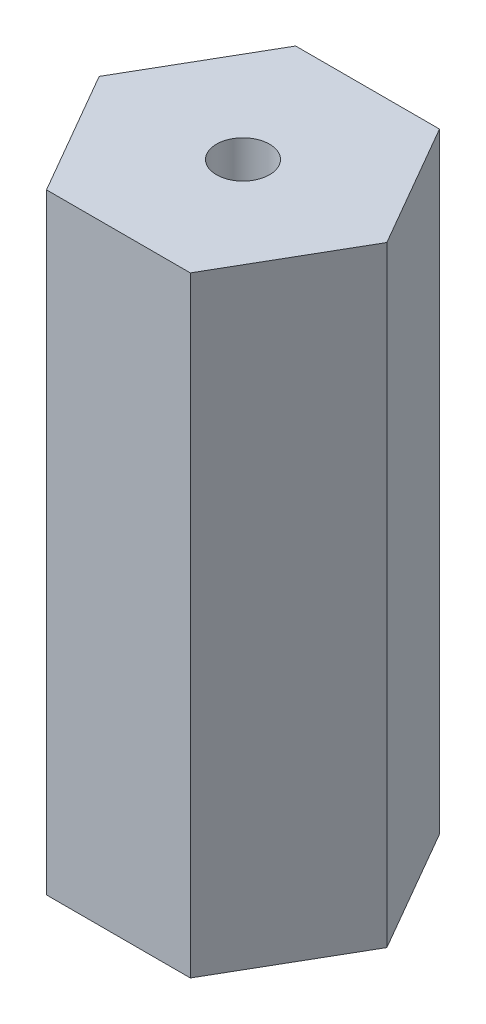
ISO-10303-21;
HEADER;
FILE_DESCRIPTION(('STEP AP214'),'2;1');
FILE_NAME('part.step','',(''),(''),'','','');
FILE_SCHEMA(('AUTOMOTIVE_DESIGN { 1 0 10303 214 1 1 1 1 }'));
ENDSEC;
DATA;
#1=APPLICATION_CONTEXT('core data for automotive mechanical design processes');
#2=APPLICATION_PROTOCOL_DEFINITION('international standard','automotive_design',2000,#1);
#3=PRODUCT_CONTEXT('',#1,'mechanical');
#4=PRODUCT('Part','Part','',(#3));
#5=PRODUCT_RELATED_PRODUCT_CATEGORY('part','',(#4));
#6=PRODUCT_DEFINITION_FORMATION('','',#4);
#7=PRODUCT_DEFINITION_CONTEXT('part definition',#1,'design');
#8=PRODUCT_DEFINITION('design','',#6,#7);
#9=PRODUCT_DEFINITION_SHAPE('','',#8);
#10=(LENGTH_UNIT() NAMED_UNIT(*) SI_UNIT(.MILLI.,.METRE.));
#11=(NAMED_UNIT(*) PLANE_ANGLE_UNIT() SI_UNIT($,.RADIAN.));
#12=(NAMED_UNIT(*) SI_UNIT($,.STERADIAN.) SOLID_ANGLE_UNIT());
#13=UNCERTAINTY_MEASURE_WITH_UNIT(LENGTH_MEASURE(1.E-05),#10,'distance_accuracy_value','');
#14=(GEOMETRIC_REPRESENTATION_CONTEXT(3) GLOBAL_UNCERTAINTY_ASSIGNED_CONTEXT((#13)) GLOBAL_UNIT_ASSIGNED_CONTEXT((#10,
#11,#12)) REPRESENTATION_CONTEXT('',''));
#15=CARTESIAN_POINT('',(0.,0.,0.));
#16=DIRECTION('',(0.,0.,1.));
#17=DIRECTION('',(1.,0.,0.));
#18=AXIS2_PLACEMENT_3D('',#15,#16,#17);
#19=CARTESIAN_POINT('',(7.04367328411343,29.90078,0.));
#20=DIRECTION('',(-0.866025403784439,0.,0.5));
#21=DIRECTION('',(0.5,0.,0.866025403784439));
#22=AXIS2_PLACEMENT_3D('',#19,#20,#21);
#23=PLANE('',#22);
#24=DIRECTION('',(-0.5,0.,-0.866025403784439));
#25=VECTOR('',#24,1.);
#26=CARTESIAN_POINT('',(7.04367328411343,0.,0.));
#27=LINE('',#26,#25);
#28=CARTESIAN_POINT('',(7.04367328411343,0.,0.));
#29=VERTEX_POINT('',#28);
#30=CARTESIAN_POINT('',(3.52183664205672,0.,-6.1));
#31=VERTEX_POINT('',#30);
#32=EDGE_CURVE('E121',#29,#31,#27,.T.);
#33=ORIENTED_EDGE('',*,*,#32,.T.);
#34=DIRECTION('',(0.,-1.,0.));
#35=VECTOR('',#34,1.);
#36=CARTESIAN_POINT('',(3.52183664205672,29.90078,-6.1));
#37=LINE('',#36,#35);
#38=CARTESIAN_POINT('',(3.52183664205672,29.90078,-6.1));
#39=VERTEX_POINT('',#38);
#40=EDGE_CURVE('E11',#39,#31,#37,.T.);
#41=ORIENTED_EDGE('',*,*,#40,.F.);
#42=DIRECTION('',(-0.5,0.,-0.866025403784439));
#43=VECTOR('',#42,1.);
#44=CARTESIAN_POINT('',(7.04367328411343,29.90078,0.));
#45=LINE('',#44,#43);
#46=CARTESIAN_POINT('',(7.04367328411343,29.90078,0.));
#47=VERTEX_POINT('',#46);
#48=EDGE_CURVE('E132',#47,#39,#45,.T.);
#49=ORIENTED_EDGE('',*,*,#48,.F.);
#50=DIRECTION('',(0.,-1.,0.));
#51=VECTOR('',#50,1.);
#52=CARTESIAN_POINT('',(7.04367328411343,29.90078,0.));
#53=LINE('',#52,#51);
#54=EDGE_CURVE('E117',#47,#29,#53,.T.);
#55=ORIENTED_EDGE('',*,*,#54,.T.);
#56=EDGE_LOOP('',(#33,#41,#49,#55));
#57=FACE_BOUND('',#56,.T.);
#58=ADVANCED_FACE('F37',(#57),#23,.F.);
#59=CARTESIAN_POINT('',(3.52183664205672,29.90078,-6.1));
#60=DIRECTION('',(0.,0.,1.));
#61=DIRECTION('',(1.,0.,0.));
#62=AXIS2_PLACEMENT_3D('',#59,#60,#61);
#63=PLANE('',#62);
#64=DIRECTION('',(-1.,0.,0.));
#65=VECTOR('',#64,1.);
#66=CARTESIAN_POINT('',(3.52183664205672,0.,-6.1));
#67=LINE('',#66,#65);
#68=CARTESIAN_POINT('',(-3.52183664205672,0.,-6.1));
#69=VERTEX_POINT('',#68);
#70=EDGE_CURVE('E124',#31,#69,#67,.T.);
#71=ORIENTED_EDGE('',*,*,#70,.T.);
#72=DIRECTION('',(0.,-1.,0.));
#73=VECTOR('',#72,1.);
#74=CARTESIAN_POINT('',(-3.52183664205672,29.90078,-6.1));
#75=LINE('',#74,#73);
#76=CARTESIAN_POINT('',(-3.52183664205672,29.90078,-6.1));
#77=VERTEX_POINT('',#76);
#78=EDGE_CURVE('E45',#77,#69,#75,.T.);
#79=ORIENTED_EDGE('',*,*,#78,.F.);
#80=DIRECTION('',(-1.,0.,0.));
#81=VECTOR('',#80,1.);
#82=CARTESIAN_POINT('',(3.52183664205672,29.90078,-6.1));
#83=LINE('',#82,#81);
#84=EDGE_CURVE('E90',#39,#77,#83,.T.);
#85=ORIENTED_EDGE('',*,*,#84,.F.);
#86=ORIENTED_EDGE('',*,*,#40,.T.);
#87=EDGE_LOOP('',(#71,#79,#85,#86));
#88=FACE_BOUND('',#87,.T.);
#89=ADVANCED_FACE('F157',(#88),#63,.F.);
#90=CARTESIAN_POINT('',(-3.52183664205672,29.90078,-6.1));
#91=DIRECTION('',(0.866025403784439,0.,0.5));
#92=DIRECTION('',(0.5,0.,-0.866025403784439));
#93=AXIS2_PLACEMENT_3D('',#90,#91,#92);
#94=PLANE('',#93);
#95=DIRECTION('',(-0.5,0.,0.866025403784439));
#96=VECTOR('',#95,1.);
#97=CARTESIAN_POINT('',(-3.52183664205672,0.,-6.1));
#98=LINE('',#97,#96);
#99=CARTESIAN_POINT('',(-7.04367328411343,0.,0.));
#100=VERTEX_POINT('',#99);
#101=EDGE_CURVE('E127',#69,#100,#98,.T.);
#102=ORIENTED_EDGE('',*,*,#101,.T.);
#103=DIRECTION('',(0.,-1.,0.));
#104=VECTOR('',#103,1.);
#105=CARTESIAN_POINT('',(-7.04367328411343,29.90078,0.));
#106=LINE('',#105,#104);
#107=CARTESIAN_POINT('',(-7.04367328411343,29.90078,0.));
#108=VERTEX_POINT('',#107);
#109=EDGE_CURVE('E112',#108,#100,#106,.T.);
#110=ORIENTED_EDGE('',*,*,#109,.F.);
#111=DIRECTION('',(-0.5,0.,0.866025403784439));
#112=VECTOR('',#111,1.);
#113=CARTESIAN_POINT('',(-3.52183664205672,29.90078,-6.1));
#114=LINE('',#113,#112);
#115=EDGE_CURVE('E103',#77,#108,#114,.T.);
#116=ORIENTED_EDGE('',*,*,#115,.F.);
#117=ORIENTED_EDGE('',*,*,#78,.T.);
#118=EDGE_LOOP('',(#102,#110,#116,#117));
#119=FACE_BOUND('',#118,.T.);
#120=ADVANCED_FACE('F138',(#119),#94,.F.);
#121=CARTESIAN_POINT('',(-7.04367328411343,29.90078,0.));
#122=DIRECTION('',(0.866025403784439,0.,-0.5));
#123=DIRECTION('',(-0.5,0.,-0.866025403784439));
#124=AXIS2_PLACEMENT_3D('',#121,#122,#123);
#125=PLANE('',#124);
#126=DIRECTION('',(0.5,0.,0.866025403784439));
#127=VECTOR('',#126,1.);
#128=CARTESIAN_POINT('',(-7.04367328411343,0.,0.));
#129=LINE('',#128,#127);
#130=CARTESIAN_POINT('',(-3.52183664205671,0.,6.1));
#131=VERTEX_POINT('',#130);
#132=EDGE_CURVE('E111',#100,#131,#129,.T.);
#133=ORIENTED_EDGE('',*,*,#132,.T.);
#134=DIRECTION('',(0.,-1.,0.));
#135=VECTOR('',#134,1.);
#136=CARTESIAN_POINT('',(-3.52183664205671,29.90078,6.1));
#137=LINE('',#136,#135);
#138=CARTESIAN_POINT('',(-3.52183664205671,29.90078,6.1));
#139=VERTEX_POINT('',#138);
#140=EDGE_CURVE('E108',#139,#131,#137,.T.);
#141=ORIENTED_EDGE('',*,*,#140,.F.);
#142=DIRECTION('',(0.5,0.,0.866025403784439));
#143=VECTOR('',#142,1.);
#144=CARTESIAN_POINT('',(-7.04367328411343,29.90078,0.));
#145=LINE('',#144,#143);
#146=EDGE_CURVE('E97',#108,#139,#145,.T.);
#147=ORIENTED_EDGE('',*,*,#146,.F.);
#148=ORIENTED_EDGE('',*,*,#109,.T.);
#149=EDGE_LOOP('',(#133,#141,#147,#148));
#150=FACE_BOUND('',#149,.T.);
#151=ADVANCED_FACE('F109',(#150),#125,.F.);
#152=CARTESIAN_POINT('',(-3.52183664205671,29.90078,6.1));
#153=DIRECTION('',(0.,0.,-1.));
#154=DIRECTION('',(-1.,0.,0.));
#155=AXIS2_PLACEMENT_3D('',#152,#153,#154);
#156=PLANE('',#155);
#157=DIRECTION('',(1.,0.,0.));
#158=VECTOR('',#157,1.);
#159=CARTESIAN_POINT('',(-3.52183664205671,0.,6.1));
#160=LINE('',#159,#158);
#161=CARTESIAN_POINT('',(3.52183664205672,0.,6.1));
#162=VERTEX_POINT('',#161);
#163=EDGE_CURVE('E76',#131,#162,#160,.T.);
#164=ORIENTED_EDGE('',*,*,#163,.T.);
#165=DIRECTION('',(0.,-1.,0.));
#166=VECTOR('',#165,1.);
#167=CARTESIAN_POINT('',(3.52183664205672,29.90078,6.1));
#168=LINE('',#167,#166);
#169=CARTESIAN_POINT('',(3.52183664205672,29.90078,6.1));
#170=VERTEX_POINT('',#169);
#171=EDGE_CURVE('E113',#170,#162,#168,.T.);
#172=ORIENTED_EDGE('',*,*,#171,.F.);
#173=DIRECTION('',(1.,0.,0.));
#174=VECTOR('',#173,1.);
#175=CARTESIAN_POINT('',(-3.52183664205671,29.90078,6.1));
#176=LINE('',#175,#174);
#177=EDGE_CURVE('E101',#139,#170,#176,.T.);
#178=ORIENTED_EDGE('',*,*,#177,.F.);
#179=ORIENTED_EDGE('',*,*,#140,.T.);
#180=EDGE_LOOP('',(#164,#172,#178,#179));
#181=FACE_BOUND('',#180,.T.);
#182=ADVANCED_FACE('F115',(#181),#156,.F.);
#183=CARTESIAN_POINT('',(3.52183664205672,29.90078,6.1));
#184=DIRECTION('',(-0.866025403784439,0.,-0.5));
#185=DIRECTION('',(-0.5,0.,0.866025403784439));
#186=AXIS2_PLACEMENT_3D('',#183,#184,#185);
#187=PLANE('',#186);
#188=DIRECTION('',(0.5,0.,-0.866025403784439));
#189=VECTOR('',#188,1.);
#190=CARTESIAN_POINT('',(3.52183664205672,0.,6.1));
#191=LINE('',#190,#189);
#192=EDGE_CURVE('E82',#162,#29,#191,.T.);
#193=ORIENTED_EDGE('',*,*,#192,.T.);
#194=ORIENTED_EDGE('',*,*,#54,.F.);
#195=DIRECTION('',(0.5,0.,-0.866025403784439));
#196=VECTOR('',#195,1.);
#197=CARTESIAN_POINT('',(3.52183664205672,29.90078,6.1));
#198=LINE('',#197,#196);
#199=EDGE_CURVE('E53',#170,#47,#198,.T.);
#200=ORIENTED_EDGE('',*,*,#199,.F.);
#201=ORIENTED_EDGE('',*,*,#171,.T.);
#202=EDGE_LOOP('',(#193,#194,#200,#201));
#203=FACE_BOUND('',#202,.T.);
#204=ADVANCED_FACE('F145',(#203),#187,.F.);
#205=CARTESIAN_POINT('',(0.,29.90078,0.));
#206=DIRECTION('',(0.,1.,0.));
#207=DIRECTION('',(0.,0.,1.));
#208=AXIS2_PLACEMENT_3D('',#205,#206,#207);
#209=PLANE('',#208);
#210=CARTESIAN_POINT('',(0.,29.90078,0.));
#211=DIRECTION('',(0.,1.,0.));
#212=DIRECTION('',(0.,0.,1.));
#213=AXIS2_PLACEMENT_3D('',#210,#211,#212);
#214=CIRCLE('',#213,1.3);
#215=CARTESIAN_POINT('',(0.,29.90078,1.3));
#216=VERTEX_POINT('',#215);
#217=EDGE_CURVE('E244',#216,#216,#214,.T.);
#218=ORIENTED_EDGE('',*,*,#217,.F.);
#219=EDGE_LOOP('',(#218));
#220=FACE_BOUND('',#219,.T.);
#221=ORIENTED_EDGE('',*,*,#48,.T.);
#222=ORIENTED_EDGE('',*,*,#84,.T.);
#223=ORIENTED_EDGE('',*,*,#115,.T.);
#224=ORIENTED_EDGE('',*,*,#146,.T.);
#225=ORIENTED_EDGE('',*,*,#177,.T.);
#226=ORIENTED_EDGE('',*,*,#199,.T.);
#227=EDGE_LOOP('',(#221,#222,#223,#224,#225,#226));
#228=FACE_BOUND('',#227,.T.);
#229=ADVANCED_FACE('F99',(#220,#228),#209,.T.);
#230=CARTESIAN_POINT('',(0.,0.,0.));
#231=DIRECTION('',(0.,1.,0.));
#232=DIRECTION('',(0.,0.,1.));
#233=AXIS2_PLACEMENT_3D('',#230,#231,#232);
#234=PLANE('',#233);
#235=CARTESIAN_POINT('',(0.,0.,0.));
#236=DIRECTION('',(0.,1.,0.));
#237=DIRECTION('',(0.,0.,1.));
#238=AXIS2_PLACEMENT_3D('',#235,#236,#237);
#239=CIRCLE('',#238,1.3);
#240=CARTESIAN_POINT('',(0.,0.,1.3));
#241=VERTEX_POINT('',#240);
#242=EDGE_CURVE('E125',#241,#241,#239,.T.);
#243=ORIENTED_EDGE('',*,*,#242,.T.);
#244=EDGE_LOOP('',(#243));
#245=FACE_BOUND('',#244,.T.);
#246=ORIENTED_EDGE('',*,*,#32,.F.);
#247=ORIENTED_EDGE('',*,*,#192,.F.);
#248=ORIENTED_EDGE('',*,*,#163,.F.);
#249=ORIENTED_EDGE('',*,*,#132,.F.);
#250=ORIENTED_EDGE('',*,*,#101,.F.);
#251=ORIENTED_EDGE('',*,*,#70,.F.);
#252=EDGE_LOOP('',(#246,#247,#248,#249,#250,#251));
#253=FACE_BOUND('',#252,.T.);
#254=ADVANCED_FACE('F141',(#245,#253),#234,.F.);
#255=CARTESIAN_POINT('',(0.,0.,0.));
#256=DIRECTION('',(0.,1.,0.));
#257=DIRECTION('',(0.,0.,1.));
#258=AXIS2_PLACEMENT_3D('',#255,#256,#257);
#259=CYLINDRICAL_SURFACE('',#258,1.3);
#260=ORIENTED_EDGE('',*,*,#242,.F.);
#261=EDGE_LOOP('',(#260));
#262=FACE_BOUND('',#261,.T.);
#263=ORIENTED_EDGE('',*,*,#217,.T.);
#264=EDGE_LOOP('',(#263));
#265=FACE_BOUND('',#264,.T.);
#266=ADVANCED_FACE('F197',(#262,#265),#259,.F.);
#267=CLOSED_SHELL('',(#58,#89,#120,#151,#182,#204,#229,#254,#266));
#268=MANIFOLD_SOLID_BREP('B2',#267);
#269=ADVANCED_BREP_SHAPE_REPRESENTATION('',(#18,#268),#14);
#270=SHAPE_DEFINITION_REPRESENTATION(#9,#269);
ENDSEC;
END-ISO-10303-21;
